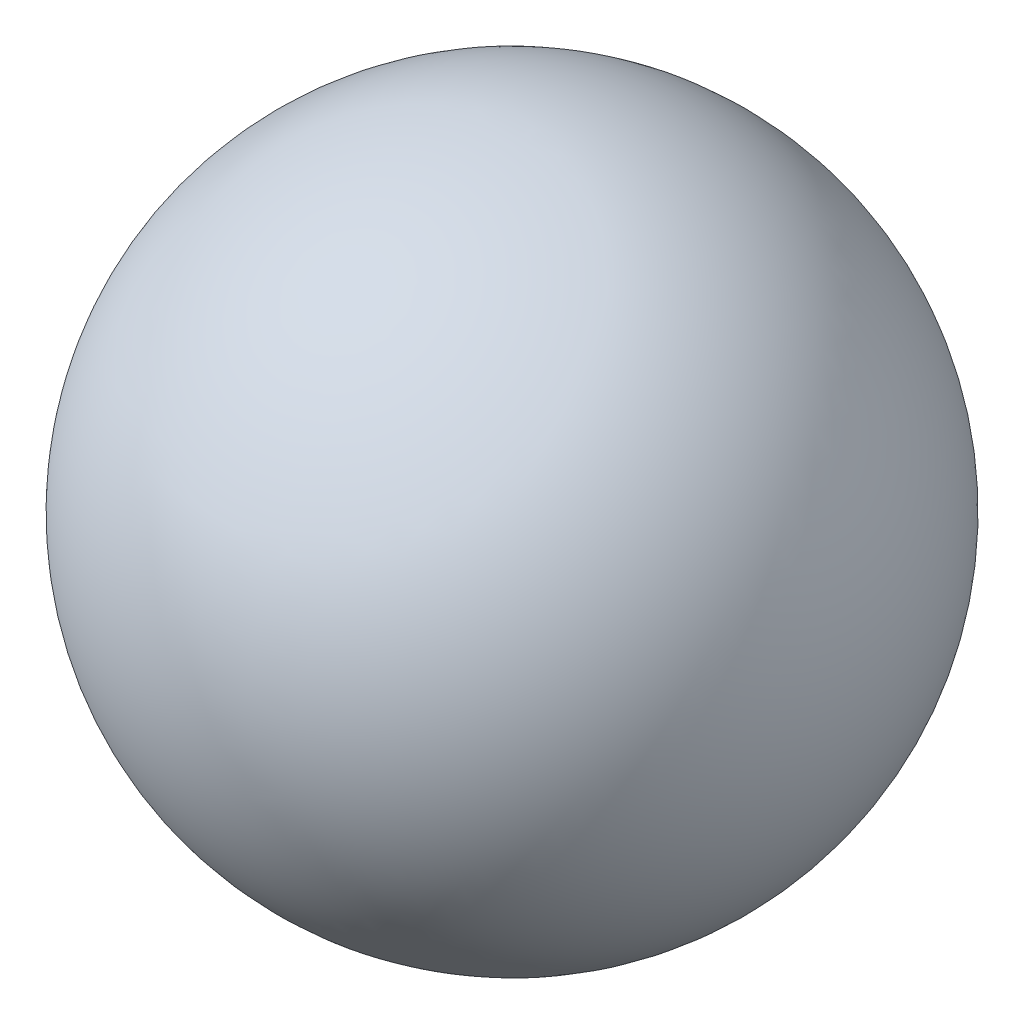
ISO-10303-21;
HEADER;
FILE_DESCRIPTION(('STEP AP214'),'2;1');
FILE_NAME('part.step','',(''),(''),'','','');
FILE_SCHEMA(('AUTOMOTIVE_DESIGN { 1 0 10303 214 1 1 1 1 }'));
ENDSEC;
DATA;
#1=APPLICATION_CONTEXT('core data for automotive mechanical design processes');
#2=APPLICATION_PROTOCOL_DEFINITION('international standard','automotive_design',2000,#1);
#3=PRODUCT_CONTEXT('',#1,'mechanical');
#4=PRODUCT('Part','Part','',(#3));
#5=PRODUCT_RELATED_PRODUCT_CATEGORY('part','',(#4));
#6=PRODUCT_DEFINITION_FORMATION('','',#4);
#7=PRODUCT_DEFINITION_CONTEXT('part definition',#1,'design');
#8=PRODUCT_DEFINITION('design','',#6,#7);
#9=PRODUCT_DEFINITION_SHAPE('','',#8);
#10=(LENGTH_UNIT() NAMED_UNIT(*) SI_UNIT(.MILLI.,.METRE.));
#11=(NAMED_UNIT(*) PLANE_ANGLE_UNIT() SI_UNIT($,.RADIAN.));
#12=(NAMED_UNIT(*) SI_UNIT($,.STERADIAN.) SOLID_ANGLE_UNIT());
#13=UNCERTAINTY_MEASURE_WITH_UNIT(LENGTH_MEASURE(1.E-05),#10,'distance_accuracy_value','');
#14=(GEOMETRIC_REPRESENTATION_CONTEXT(3) GLOBAL_UNCERTAINTY_ASSIGNED_CONTEXT((#13)) GLOBAL_UNIT_ASSIGNED_CONTEXT((#10,
#11,#12)) REPRESENTATION_CONTEXT('',''));
#15=CARTESIAN_POINT('',(0.,0.,0.));
#16=DIRECTION('',(0.,0.,1.));
#17=DIRECTION('',(1.,0.,0.));
#18=AXIS2_PLACEMENT_3D('',#15,#16,#17);
#19=CARTESIAN_POINT('',(64.16,68.0523917870283,-13.5230418569492));
#20=DIRECTION('',(0.,0.980822273280607,-0.194904254024027));
#21=DIRECTION('',(0.173648177666933,0.191943220457923,0.9659213790538));
#22=AXIS2_PLACEMENT_3D('',#19,#20,#21);
#23=SPHERICAL_SURFACE('',#22,7.15);
#24=CARTESIAN_POINT('',(64.16,61.0395125330719,-12.1294764406774));
#25=VERTEX_POINT('',#24);
#26=VERTEX_LOOP('',#25);
#27=FACE_BOUND('',#26,.T.);
#28=CARTESIAN_POINT('',(64.16,75.0652710409846,-14.916607273221));
#29=VERTEX_POINT('',#28);
#30=VERTEX_LOOP('',#29);
#31=FACE_BOUND('',#30,.T.);
#32=ADVANCED_FACE('F15',(#27,#31),#23,.T.);
#33=CLOSED_SHELL('',(#32));
#34=MANIFOLD_SOLID_BREP('B1',#33);
#35=ADVANCED_BREP_SHAPE_REPRESENTATION('',(#18,#34),#14);
#36=SHAPE_DEFINITION_REPRESENTATION(#9,#35);
ENDSEC;
END-ISO-10303-21;
